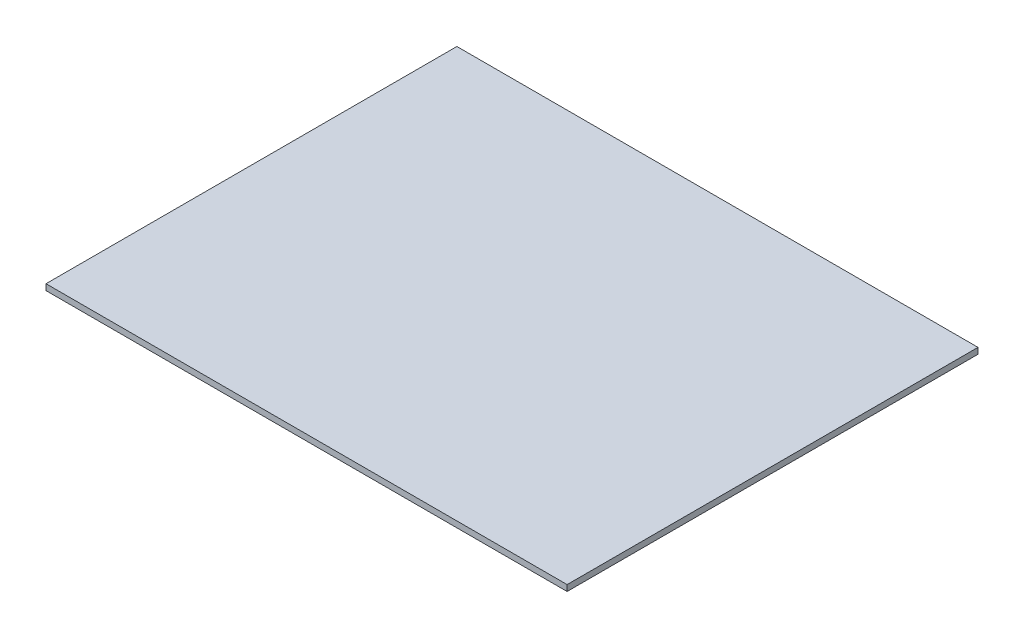
ISO-10303-21;
HEADER;
FILE_DESCRIPTION(('STEP AP214'),'2;1');
FILE_NAME('part.step','',(''),(''),'','','');
FILE_SCHEMA(('AUTOMOTIVE_DESIGN { 1 0 10303 214 1 1 1 1 }'));
ENDSEC;
DATA;
#1=APPLICATION_CONTEXT('core data for automotive mechanical design processes');
#2=APPLICATION_PROTOCOL_DEFINITION('international standard','automotive_design',2000,#1);
#3=PRODUCT_CONTEXT('',#1,'mechanical');
#4=PRODUCT('Part','Part','',(#3));
#5=PRODUCT_RELATED_PRODUCT_CATEGORY('part','',(#4));
#6=PRODUCT_DEFINITION_FORMATION('','',#4);
#7=PRODUCT_DEFINITION_CONTEXT('part definition',#1,'design');
#8=PRODUCT_DEFINITION('design','',#6,#7);
#9=PRODUCT_DEFINITION_SHAPE('','',#8);
#10=(LENGTH_UNIT() NAMED_UNIT(*) SI_UNIT(.MILLI.,.METRE.));
#11=(NAMED_UNIT(*) PLANE_ANGLE_UNIT() SI_UNIT($,.RADIAN.));
#12=(NAMED_UNIT(*) SI_UNIT($,.STERADIAN.) SOLID_ANGLE_UNIT());
#13=UNCERTAINTY_MEASURE_WITH_UNIT(LENGTH_MEASURE(1.E-05),#10,'distance_accuracy_value','');
#14=(GEOMETRIC_REPRESENTATION_CONTEXT(3) GLOBAL_UNCERTAINTY_ASSIGNED_CONTEXT((#13)) GLOBAL_UNIT_ASSIGNED_CONTEXT((#10,
#11,#12)) REPRESENTATION_CONTEXT('',''));
#15=CARTESIAN_POINT('',(0.,0.,0.));
#16=DIRECTION('',(0.,0.,1.));
#17=DIRECTION('',(1.,0.,0.));
#18=AXIS2_PLACEMENT_3D('',#15,#16,#17);
#19=CARTESIAN_POINT('',(-141.284722222222,3.,-77.8645833333333));
#20=DIRECTION('',(1.,0.,0.));
#21=DIRECTION('',(0.,0.,-1.));
#22=AXIS2_PLACEMENT_3D('',#19,#20,#21);
#23=PLANE('',#22);
#24=DIRECTION('',(0.,0.,1.));
#25=VECTOR('',#24,1.);
#26=CARTESIAN_POINT('',(-141.284722222222,0.,-77.8645833333333));
#27=LINE('',#26,#25);
#28=CARTESIAN_POINT('',(-141.284722222222,0.,-77.8645833333333));
#29=VERTEX_POINT('',#28);
#30=CARTESIAN_POINT('',(-141.284722222222,0.,127.135416666667));
#31=VERTEX_POINT('',#30);
#32=EDGE_CURVE('E96',#29,#31,#27,.T.);
#33=ORIENTED_EDGE('',*,*,#32,.T.);
#34=DIRECTION('',(0.,-1.,0.));
#35=VECTOR('',#34,1.);
#36=CARTESIAN_POINT('',(-141.284722222222,3.,127.135416666667));
#37=LINE('',#36,#35);
#38=CARTESIAN_POINT('',(-141.284722222222,3.,127.135416666667));
#39=VERTEX_POINT('',#38);
#40=EDGE_CURVE('E11',#39,#31,#37,.T.);
#41=ORIENTED_EDGE('',*,*,#40,.F.);
#42=DIRECTION('',(0.,0.,1.));
#43=VECTOR('',#42,1.);
#44=CARTESIAN_POINT('',(-141.284722222222,3.,-77.8645833333333));
#45=LINE('',#44,#43);
#46=CARTESIAN_POINT('',(-141.284722222222,3.,-77.8645833333333));
#47=VERTEX_POINT('',#46);
#48=EDGE_CURVE('E84',#47,#39,#45,.T.);
#49=ORIENTED_EDGE('',*,*,#48,.F.);
#50=DIRECTION('',(0.,-1.,0.));
#51=VECTOR('',#50,1.);
#52=CARTESIAN_POINT('',(-141.284722222222,3.,-77.8645833333333));
#53=LINE('',#52,#51);
#54=EDGE_CURVE('E92',#47,#29,#53,.T.);
#55=ORIENTED_EDGE('',*,*,#54,.T.);
#56=EDGE_LOOP('',(#33,#41,#49,#55));
#57=FACE_BOUND('',#56,.T.);
#58=ADVANCED_FACE('F33',(#57),#23,.F.);
#59=CARTESIAN_POINT('',(-141.284722222222,3.,127.135416666667));
#60=DIRECTION('',(0.,0.,-1.));
#61=DIRECTION('',(-1.,0.,0.));
#62=AXIS2_PLACEMENT_3D('',#59,#60,#61);
#63=PLANE('',#62);
#64=DIRECTION('',(1.,0.,0.));
#65=VECTOR('',#64,1.);
#66=CARTESIAN_POINT('',(-141.284722222222,0.,127.135416666667));
#67=LINE('',#66,#65);
#68=CARTESIAN_POINT('',(118.715277777778,0.,127.135416666667));
#69=VERTEX_POINT('',#68);
#70=EDGE_CURVE('E88',#31,#69,#67,.T.);
#71=ORIENTED_EDGE('',*,*,#70,.T.);
#72=DIRECTION('',(0.,-1.,0.));
#73=VECTOR('',#72,1.);
#74=CARTESIAN_POINT('',(118.715277777778,3.,127.135416666667));
#75=LINE('',#74,#73);
#76=CARTESIAN_POINT('',(118.715277777778,3.,127.135416666667));
#77=VERTEX_POINT('',#76);
#78=EDGE_CURVE('E41',#77,#69,#75,.T.);
#79=ORIENTED_EDGE('',*,*,#78,.F.);
#80=DIRECTION('',(1.,0.,0.));
#81=VECTOR('',#80,1.);
#82=CARTESIAN_POINT('',(-141.284722222222,3.,127.135416666667));
#83=LINE('',#82,#81);
#84=EDGE_CURVE('E79',#39,#77,#83,.T.);
#85=ORIENTED_EDGE('',*,*,#84,.F.);
#86=ORIENTED_EDGE('',*,*,#40,.T.);
#87=EDGE_LOOP('',(#71,#79,#85,#86));
#88=FACE_BOUND('',#87,.T.);
#89=ADVANCED_FACE('F87',(#88),#63,.F.);
#90=CARTESIAN_POINT('',(118.715277777778,3.,-77.8645833333333));
#91=DIRECTION('',(-1.,0.,0.));
#92=DIRECTION('',(0.,0.,1.));
#93=AXIS2_PLACEMENT_3D('',#90,#91,#92);
#94=PLANE('',#93);
#95=DIRECTION('',(0.,0.,-1.));
#96=VECTOR('',#95,1.);
#97=CARTESIAN_POINT('',(118.715277777778,0.,-77.8645833333333));
#98=LINE('',#97,#96);
#99=CARTESIAN_POINT('',(118.715277777778,0.,-77.8645833333333));
#100=VERTEX_POINT('',#99);
#101=EDGE_CURVE('E66',#69,#100,#98,.T.);
#102=ORIENTED_EDGE('',*,*,#101,.T.);
#103=DIRECTION('',(0.,-1.,0.));
#104=VECTOR('',#103,1.);
#105=CARTESIAN_POINT('',(118.715277777778,3.,-77.8645833333333));
#106=LINE('',#105,#104);
#107=CARTESIAN_POINT('',(118.715277777778,3.,-77.8645833333333));
#108=VERTEX_POINT('',#107);
#109=EDGE_CURVE('E89',#108,#100,#106,.T.);
#110=ORIENTED_EDGE('',*,*,#109,.F.);
#111=DIRECTION('',(0.,0.,-1.));
#112=VECTOR('',#111,1.);
#113=CARTESIAN_POINT('',(118.715277777778,3.,-77.8645833333333));
#114=LINE('',#113,#112);
#115=EDGE_CURVE('E82',#77,#108,#114,.T.);
#116=ORIENTED_EDGE('',*,*,#115,.F.);
#117=ORIENTED_EDGE('',*,*,#78,.T.);
#118=EDGE_LOOP('',(#102,#110,#116,#117));
#119=FACE_BOUND('',#118,.T.);
#120=ADVANCED_FACE('F90',(#119),#94,.F.);
#121=CARTESIAN_POINT('',(-141.284722222222,3.,-77.8645833333333));
#122=DIRECTION('',(0.,0.,1.));
#123=DIRECTION('',(1.,0.,0.));
#124=AXIS2_PLACEMENT_3D('',#121,#122,#123);
#125=PLANE('',#124);
#126=DIRECTION('',(-1.,0.,0.));
#127=VECTOR('',#126,1.);
#128=CARTESIAN_POINT('',(-141.284722222222,0.,-77.8645833333333));
#129=LINE('',#128,#127);
#130=EDGE_CURVE('E72',#100,#29,#129,.T.);
#131=ORIENTED_EDGE('',*,*,#130,.T.);
#132=ORIENTED_EDGE('',*,*,#54,.F.);
#133=DIRECTION('',(-1.,0.,0.));
#134=VECTOR('',#133,1.);
#135=CARTESIAN_POINT('',(-141.284722222222,3.,-77.8645833333333));
#136=LINE('',#135,#134);
#137=EDGE_CURVE('E49',#108,#47,#136,.T.);
#138=ORIENTED_EDGE('',*,*,#137,.F.);
#139=ORIENTED_EDGE('',*,*,#109,.T.);
#140=EDGE_LOOP('',(#131,#132,#138,#139));
#141=FACE_BOUND('',#140,.T.);
#142=ADVANCED_FACE('F103',(#141),#125,.F.);
#143=CARTESIAN_POINT('',(0.,3.,0.));
#144=DIRECTION('',(0.,1.,0.));
#145=DIRECTION('',(0.,0.,1.));
#146=AXIS2_PLACEMENT_3D('',#143,#144,#145);
#147=PLANE('',#146);
#148=ORIENTED_EDGE('',*,*,#48,.T.);
#149=ORIENTED_EDGE('',*,*,#84,.T.);
#150=ORIENTED_EDGE('',*,*,#115,.T.);
#151=ORIENTED_EDGE('',*,*,#137,.T.);
#152=EDGE_LOOP('',(#148,#149,#150,#151));
#153=FACE_BOUND('',#152,.T.);
#154=ADVANCED_FACE('F80',(#153),#147,.T.);
#155=CARTESIAN_POINT('',(0.,0.,0.));
#156=DIRECTION('',(0.,1.,0.));
#157=DIRECTION('',(0.,0.,1.));
#158=AXIS2_PLACEMENT_3D('',#155,#156,#157);
#159=PLANE('',#158);
#160=ORIENTED_EDGE('',*,*,#32,.F.);
#161=ORIENTED_EDGE('',*,*,#130,.F.);
#162=ORIENTED_EDGE('',*,*,#101,.F.);
#163=ORIENTED_EDGE('',*,*,#70,.F.);
#164=EDGE_LOOP('',(#160,#161,#162,#163));
#165=FACE_BOUND('',#164,.T.);
#166=ADVANCED_FACE('F106',(#165),#159,.F.);
#167=CLOSED_SHELL('',(#58,#89,#120,#142,#154,#166));
#168=MANIFOLD_SOLID_BREP('B2',#167);
#169=ADVANCED_BREP_SHAPE_REPRESENTATION('',(#18,#168),#14);
#170=SHAPE_DEFINITION_REPRESENTATION(#9,#169);
ENDSEC;
END-ISO-10303-21;
